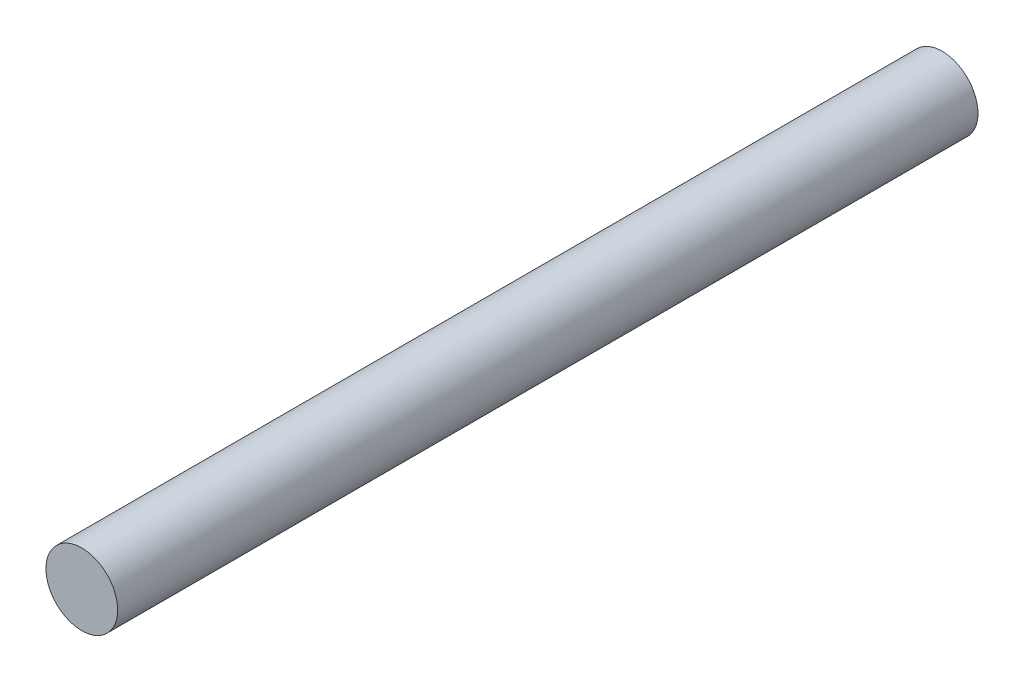
ISO-10303-21;
HEADER;
FILE_DESCRIPTION(('STEP AP214'),'2;1');
FILE_NAME('part.step','',(''),(''),'','','');
FILE_SCHEMA(('AUTOMOTIVE_DESIGN { 1 0 10303 214 1 1 1 1 }'));
ENDSEC;
DATA;
#1=APPLICATION_CONTEXT('core data for automotive mechanical design processes');
#2=APPLICATION_PROTOCOL_DEFINITION('international standard','automotive_design',2000,#1);
#3=PRODUCT_CONTEXT('',#1,'mechanical');
#4=PRODUCT('Part','Part','',(#3));
#5=PRODUCT_RELATED_PRODUCT_CATEGORY('part','',(#4));
#6=PRODUCT_DEFINITION_FORMATION('','',#4);
#7=PRODUCT_DEFINITION_CONTEXT('part definition',#1,'design');
#8=PRODUCT_DEFINITION('design','',#6,#7);
#9=PRODUCT_DEFINITION_SHAPE('','',#8);
#10=(LENGTH_UNIT() NAMED_UNIT(*) SI_UNIT(.MILLI.,.METRE.));
#11=(NAMED_UNIT(*) PLANE_ANGLE_UNIT() SI_UNIT($,.RADIAN.));
#12=(NAMED_UNIT(*) SI_UNIT($,.STERADIAN.) SOLID_ANGLE_UNIT());
#13=UNCERTAINTY_MEASURE_WITH_UNIT(LENGTH_MEASURE(1.E-05),#10,'distance_accuracy_value','');
#14=(GEOMETRIC_REPRESENTATION_CONTEXT(3) GLOBAL_UNCERTAINTY_ASSIGNED_CONTEXT((#13)) GLOBAL_UNIT_ASSIGNED_CONTEXT((#10,
#11,#12)) REPRESENTATION_CONTEXT('',''));
#15=CARTESIAN_POINT('',(0.,0.,0.));
#16=DIRECTION('',(0.,0.,1.));
#17=DIRECTION('',(1.,0.,0.));
#18=AXIS2_PLACEMENT_3D('',#15,#16,#17);
#19=CARTESIAN_POINT('',(0.,0.,152.4));
#20=DIRECTION('',(0.,0.,-1.));
#21=DIRECTION('',(-1.,0.,0.));
#22=AXIS2_PLACEMENT_3D('',#19,#20,#21);
#23=CYLINDRICAL_SURFACE('',#22,6.35);
#24=CARTESIAN_POINT('',(0.,0.,152.4));
#25=DIRECTION('',(0.,0.,1.));
#26=DIRECTION('',(1.,0.,0.));
#27=AXIS2_PLACEMENT_3D('',#24,#25,#26);
#28=CIRCLE('',#27,6.35);
#29=CARTESIAN_POINT('',(6.35,0.,152.4));
#30=VERTEX_POINT('',#29);
#31=EDGE_CURVE('E10',#30,#30,#28,.T.);
#32=ORIENTED_EDGE('',*,*,#31,.F.);
#33=EDGE_LOOP('',(#32));
#34=FACE_BOUND('',#33,.T.);
#35=CARTESIAN_POINT('',(0.,0.,0.));
#36=DIRECTION('',(0.,0.,1.));
#37=DIRECTION('',(1.,0.,0.));
#38=AXIS2_PLACEMENT_3D('',#35,#36,#37);
#39=CIRCLE('',#38,6.35);
#40=CARTESIAN_POINT('',(6.35,0.,0.));
#41=VERTEX_POINT('',#40);
#42=EDGE_CURVE('E40',#41,#41,#39,.T.);
#43=ORIENTED_EDGE('',*,*,#42,.T.);
#44=EDGE_LOOP('',(#43));
#45=FACE_BOUND('',#44,.T.);
#46=ADVANCED_FACE('F37',(#34,#45),#23,.T.);
#47=CARTESIAN_POINT('',(0.,0.,152.4));
#48=DIRECTION('',(0.,0.,1.));
#49=DIRECTION('',(1.,0.,0.));
#50=AXIS2_PLACEMENT_3D('',#47,#48,#49);
#51=PLANE('',#50);
#52=ORIENTED_EDGE('',*,*,#31,.T.);
#53=EDGE_LOOP('',(#52));
#54=FACE_BOUND('',#53,.T.);
#55=ADVANCED_FACE('F54',(#54),#51,.T.);
#56=CARTESIAN_POINT('',(0.,0.,0.));
#57=DIRECTION('',(0.,0.,1.));
#58=DIRECTION('',(1.,0.,0.));
#59=AXIS2_PLACEMENT_3D('',#56,#57,#58);
#60=PLANE('',#59);
#61=ORIENTED_EDGE('',*,*,#42,.F.);
#62=EDGE_LOOP('',(#61));
#63=FACE_BOUND('',#62,.T.);
#64=ADVANCED_FACE('F52',(#63),#60,.F.);
#65=CLOSED_SHELL('',(#46,#55,#64));
#66=MANIFOLD_SOLID_BREP('B2',#65);
#67=ADVANCED_BREP_SHAPE_REPRESENTATION('',(#18,#66),#14);
#68=SHAPE_DEFINITION_REPRESENTATION(#9,#67);
ENDSEC;
END-ISO-10303-21;
